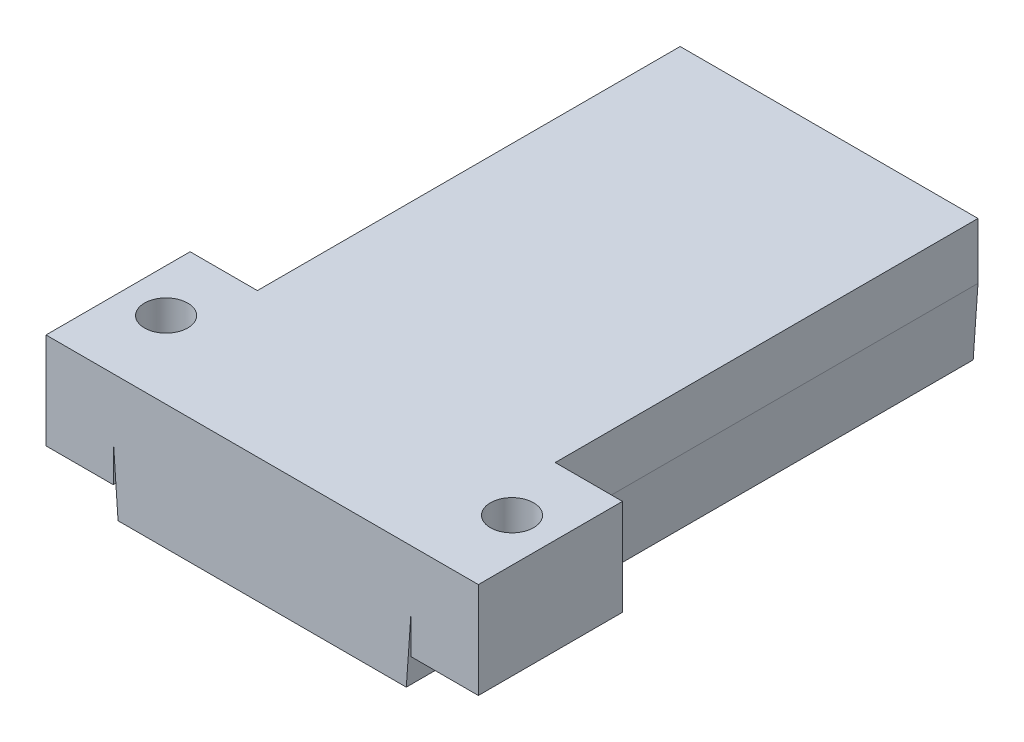
ISO-10303-21;
HEADER;
FILE_DESCRIPTION(('STEP AP214'),'2;1');
FILE_NAME('part.step','',(''),(''),'','','');
FILE_SCHEMA(('AUTOMOTIVE_DESIGN { 1 0 10303 214 1 1 1 1 }'));
ENDSEC;
DATA;
#1=APPLICATION_CONTEXT('core data for automotive mechanical design processes');
#2=APPLICATION_PROTOCOL_DEFINITION('international standard','automotive_design',2000,#1);
#3=PRODUCT_CONTEXT('',#1,'mechanical');
#4=PRODUCT('Part','Part','',(#3));
#5=PRODUCT_RELATED_PRODUCT_CATEGORY('part','',(#4));
#6=PRODUCT_DEFINITION_FORMATION('','',#4);
#7=PRODUCT_DEFINITION_CONTEXT('part definition',#1,'design');
#8=PRODUCT_DEFINITION('design','',#6,#7);
#9=PRODUCT_DEFINITION_SHAPE('','',#8);
#10=(LENGTH_UNIT() NAMED_UNIT(*) SI_UNIT(.MILLI.,.METRE.));
#11=(NAMED_UNIT(*) PLANE_ANGLE_UNIT() SI_UNIT($,.RADIAN.));
#12=(NAMED_UNIT(*) SI_UNIT($,.STERADIAN.) SOLID_ANGLE_UNIT());
#13=UNCERTAINTY_MEASURE_WITH_UNIT(LENGTH_MEASURE(1.E-05),#10,'distance_accuracy_value','');
#14=(GEOMETRIC_REPRESENTATION_CONTEXT(3) GLOBAL_UNCERTAINTY_ASSIGNED_CONTEXT((#13)) GLOBAL_UNIT_ASSIGNED_CONTEXT((#10,
#11,#12)) REPRESENTATION_CONTEXT('',''));
#15=CARTESIAN_POINT('',(0.,0.,0.));
#16=DIRECTION('',(0.,0.,1.));
#17=DIRECTION('',(1.,0.,0.));
#18=AXIS2_PLACEMENT_3D('',#15,#16,#17);
#19=CARTESIAN_POINT('',(-28.5,-5.,-56.));
#20=DIRECTION('',(-1.,0.,0.));
#21=DIRECTION('',(0.,0.,1.));
#22=AXIS2_PLACEMENT_3D('',#19,#20,#21);
#23=PLANE('',#22);
#24=DIRECTION('',(0.,0.,1.));
#25=VECTOR('',#24,1.);
#26=CARTESIAN_POINT('',(-28.5,2.15033312835588,3.));
#27=LINE('',#26,#25);
#28=CARTESIAN_POINT('',(-28.5,2.15033312835588,-56.));
#29=VERTEX_POINT('',#28);
#30=CARTESIAN_POINT('',(-28.5,2.15033312835588,-12.));
#31=VERTEX_POINT('',#30);
#32=EDGE_CURVE('E542',#29,#31,#27,.T.);
#33=ORIENTED_EDGE('',*,*,#32,.T.);
#34=DIRECTION('',(0.,1.,0.));
#35=VECTOR('',#34,1.);
#36=CARTESIAN_POINT('',(-28.5,-2.,-12.));
#37=LINE('',#36,#35);
#38=CARTESIAN_POINT('',(-28.5,8.,-12.));
#39=VERTEX_POINT('',#38);
#40=EDGE_CURVE('E11',#31,#39,#37,.T.);
#41=ORIENTED_EDGE('',*,*,#40,.T.);
#42=DIRECTION('',(0.,0.,1.));
#43=VECTOR('',#42,1.);
#44=CARTESIAN_POINT('',(-28.5,8.,-56.));
#45=LINE('',#44,#43);
#46=CARTESIAN_POINT('',(-28.5,8.,-56.));
#47=VERTEX_POINT('',#46);
#48=EDGE_CURVE('E316',#47,#39,#45,.T.);
#49=ORIENTED_EDGE('',*,*,#48,.F.);
#50=DIRECTION('',(0.,1.,0.));
#51=VECTOR('',#50,1.);
#52=CARTESIAN_POINT('',(-28.5,-5.,-56.));
#53=LINE('',#52,#51);
#54=EDGE_CURVE('E381',#29,#47,#53,.T.);
#55=ORIENTED_EDGE('',*,*,#54,.F.);
#56=EDGE_LOOP('',(#33,#41,#49,#55));
#57=FACE_BOUND('',#56,.T.);
#58=ADVANCED_FACE('F39',(#57),#23,.T.);
#59=CARTESIAN_POINT('',(0.,0.,0.));
#60=DIRECTION('',(0.,1.,0.));
#61=DIRECTION('',(0.,0.,1.));
#62=AXIS2_PLACEMENT_3D('',#59,#60,#61);
#63=PLANE('',#62);
#64=DIRECTION('',(-1.,0.,0.));
#65=VECTOR('',#64,1.);
#66=CARTESIAN_POINT('',(-22.9999999999998,0.,-32.));
#67=LINE('',#66,#65);
#68=CARTESIAN_POINT('',(-2.99999999999983,0.,-32.));
#69=VERTEX_POINT('',#68);
#70=CARTESIAN_POINT('',(-22.9999999999998,0.,-32.));
#71=VERTEX_POINT('',#70);
#72=EDGE_CURVE('E433',#69,#71,#67,.T.);
#73=ORIENTED_EDGE('',*,*,#72,.T.);
#74=DIRECTION('',(0.,0.,1.));
#75=VECTOR('',#74,1.);
#76=CARTESIAN_POINT('',(-22.9999999999998,0.,-32.));
#77=LINE('',#76,#75);
#78=CARTESIAN_POINT('',(-22.9999999999998,0.,-22.));
#79=VERTEX_POINT('',#78);
#80=EDGE_CURVE('E455',#71,#79,#77,.T.);
#81=ORIENTED_EDGE('',*,*,#80,.T.);
#82=DIRECTION('',(1.,0.,0.));
#83=VECTOR('',#82,1.);
#84=CARTESIAN_POINT('',(-22.9999999999998,0.,-22.));
#85=LINE('',#84,#83);
#86=CARTESIAN_POINT('',(-2.99999999999984,0.,-22.));
#87=VERTEX_POINT('',#86);
#88=EDGE_CURVE('E459',#79,#87,#85,.T.);
#89=ORIENTED_EDGE('',*,*,#88,.T.);
#90=DIRECTION('',(0.,0.,-1.));
#91=VECTOR('',#90,1.);
#92=CARTESIAN_POINT('',(-2.99999999999983,0.,-32.));
#93=LINE('',#92,#91);
#94=EDGE_CURVE('E439',#87,#69,#93,.T.);
#95=ORIENTED_EDGE('',*,*,#94,.T.);
#96=EDGE_LOOP('',(#73,#81,#89,#95));
#97=FACE_BOUND('',#96,.T.);
#98=DIRECTION('',(0.,0.,-1.));
#99=VECTOR('',#98,1.);
#100=CARTESIAN_POINT('',(0.,0.,0.));
#101=LINE('',#100,#99);
#102=CARTESIAN_POINT('',(0.,0.,0.));
#103=VERTEX_POINT('',#102);
#104=CARTESIAN_POINT('',(0.,0.,-53.));
#105=VERTEX_POINT('',#104);
#106=EDGE_CURVE('E525',#103,#105,#101,.T.);
#107=ORIENTED_EDGE('',*,*,#106,.F.);
#108=DIRECTION('',(1.,0.,0.));
#109=VECTOR('',#108,1.);
#110=CARTESIAN_POINT('',(0.,0.,0.));
#111=LINE('',#110,#109);
#112=CARTESIAN_POINT('',(-26.,0.,0.));
#113=VERTEX_POINT('',#112);
#114=EDGE_CURVE('E537',#113,#103,#111,.T.);
#115=ORIENTED_EDGE('',*,*,#114,.F.);
#116=DIRECTION('',(0.,0.,1.));
#117=VECTOR('',#116,1.);
#118=CARTESIAN_POINT('',(-26.,0.,0.));
#119=LINE('',#118,#117);
#120=CARTESIAN_POINT('',(-26.,0.,-53.));
#121=VERTEX_POINT('',#120);
#122=EDGE_CURVE('E533',#121,#113,#119,.T.);
#123=ORIENTED_EDGE('',*,*,#122,.F.);
#124=DIRECTION('',(-1.,0.,0.));
#125=VECTOR('',#124,1.);
#126=CARTESIAN_POINT('',(0.,0.,-53.));
#127=LINE('',#126,#125);
#128=EDGE_CURVE('E529',#105,#121,#127,.T.);
#129=ORIENTED_EDGE('',*,*,#128,.F.);
#130=EDGE_LOOP('',(#107,#115,#123,#129));
#131=FACE_BOUND('',#130,.T.);
#132=DIRECTION('',(0.,0.,1.));
#133=VECTOR('',#132,1.);
#134=CARTESIAN_POINT('',(-23.,0.,-48.));
#135=LINE('',#134,#133);
#136=CARTESIAN_POINT('',(-23.,0.,-48.));
#137=VERTEX_POINT('',#136);
#138=CARTESIAN_POINT('',(-23.,0.,-38.));
#139=VERTEX_POINT('',#138);
#140=EDGE_CURVE('E479',#137,#139,#135,.T.);
#141=ORIENTED_EDGE('',*,*,#140,.T.);
#142=DIRECTION('',(1.,0.,0.));
#143=VECTOR('',#142,1.);
#144=CARTESIAN_POINT('',(-23.,0.,-38.));
#145=LINE('',#144,#143);
#146=CARTESIAN_POINT('',(-3.,0.,-38.));
#147=VERTEX_POINT('',#146);
#148=EDGE_CURVE('E501',#139,#147,#145,.T.);
#149=ORIENTED_EDGE('',*,*,#148,.T.);
#150=DIRECTION('',(0.,0.,-1.));
#151=VECTOR('',#150,1.);
#152=CARTESIAN_POINT('',(-3.,0.,-48.));
#153=LINE('',#152,#151);
#154=CARTESIAN_POINT('',(-3.,0.,-48.));
#155=VERTEX_POINT('',#154);
#156=EDGE_CURVE('E505',#147,#155,#153,.T.);
#157=ORIENTED_EDGE('',*,*,#156,.T.);
#158=DIRECTION('',(-1.,0.,0.));
#159=VECTOR('',#158,1.);
#160=CARTESIAN_POINT('',(-23.,0.,-48.));
#161=LINE('',#160,#159);
#162=EDGE_CURVE('E485',#155,#137,#161,.T.);
#163=ORIENTED_EDGE('',*,*,#162,.T.);
#164=EDGE_LOOP('',(#141,#149,#157,#163));
#165=FACE_BOUND('',#164,.T.);
#166=DIRECTION('',(-1.,0.,0.));
#167=VECTOR('',#166,1.);
#168=CARTESIAN_POINT('',(-22.9999999999997,0.,-16.));
#169=LINE('',#168,#167);
#170=CARTESIAN_POINT('',(-2.99999999999966,0.,-16.));
#171=VERTEX_POINT('',#170);
#172=CARTESIAN_POINT('',(-22.9999999999997,0.,-16.));
#173=VERTEX_POINT('',#172);
#174=EDGE_CURVE('E384',#171,#173,#169,.T.);
#175=ORIENTED_EDGE('',*,*,#174,.T.);
#176=DIRECTION('',(0.,0.,1.));
#177=VECTOR('',#176,1.);
#178=CARTESIAN_POINT('',(-22.9999999999997,0.,-16.));
#179=LINE('',#178,#177);
#180=CARTESIAN_POINT('',(-22.9999999999997,0.,-6.));
#181=VERTEX_POINT('',#180);
#182=EDGE_CURVE('E409',#173,#181,#179,.T.);
#183=ORIENTED_EDGE('',*,*,#182,.T.);
#184=DIRECTION('',(1.,0.,0.));
#185=VECTOR('',#184,1.);
#186=CARTESIAN_POINT('',(-22.9999999999997,0.,-6.));
#187=LINE('',#186,#185);
#188=CARTESIAN_POINT('',(-2.99999999999967,0.,-6.));
#189=VERTEX_POINT('',#188);
#190=EDGE_CURVE('E413',#181,#189,#187,.T.);
#191=ORIENTED_EDGE('',*,*,#190,.T.);
#192=DIRECTION('',(0.,0.,-1.));
#193=VECTOR('',#192,1.);
#194=CARTESIAN_POINT('',(-2.99999999999966,0.,-16.));
#195=LINE('',#194,#193);
#196=EDGE_CURVE('E393',#189,#171,#195,.T.);
#197=ORIENTED_EDGE('',*,*,#196,.T.);
#198=EDGE_LOOP('',(#175,#183,#191,#197));
#199=FACE_BOUND('',#198,.T.);
#200=ADVANCED_FACE('F611',(#97,#131,#165,#199),#63,.F.);
#201=CARTESIAN_POINT('',(-23.,5.,-48.));
#202=DIRECTION('',(1.,0.,0.));
#203=DIRECTION('',(0.,0.,-1.));
#204=AXIS2_PLACEMENT_3D('',#201,#202,#203);
#205=PLANE('',#204);
#206=ORIENTED_EDGE('',*,*,#140,.F.);
#207=DIRECTION('',(0.,-1.,0.));
#208=VECTOR('',#207,1.);
#209=CARTESIAN_POINT('',(-23.,5.,-48.));
#210=LINE('',#209,#208);
#211=CARTESIAN_POINT('',(-23.,5.,-48.));
#212=VERTEX_POINT('',#211);
#213=EDGE_CURVE('E497',#212,#137,#210,.T.);
#214=ORIENTED_EDGE('',*,*,#213,.F.);
#215=DIRECTION('',(0.,0.,1.));
#216=VECTOR('',#215,1.);
#217=CARTESIAN_POINT('',(-23.,5.,-48.));
#218=LINE('',#217,#216);
#219=CARTESIAN_POINT('',(-23.,5.,-38.));
#220=VERTEX_POINT('',#219);
#221=EDGE_CURVE('E480',#212,#220,#218,.T.);
#222=ORIENTED_EDGE('',*,*,#221,.T.);
#223=DIRECTION('',(0.,-1.,0.));
#224=VECTOR('',#223,1.);
#225=CARTESIAN_POINT('',(-23.,5.,-38.));
#226=LINE('',#225,#224);
#227=EDGE_CURVE('E521',#220,#139,#226,.T.);
#228=ORIENTED_EDGE('',*,*,#227,.T.);
#229=EDGE_LOOP('',(#206,#214,#222,#228));
#230=FACE_BOUND('',#229,.T.);
#231=ADVANCED_FACE('F617',(#230),#205,.T.);
#232=CARTESIAN_POINT('',(-23.,5.,-38.));
#233=DIRECTION('',(0.,0.,-1.));
#234=DIRECTION('',(-1.,0.,0.));
#235=AXIS2_PLACEMENT_3D('',#232,#233,#234);
#236=PLANE('',#235);
#237=ORIENTED_EDGE('',*,*,#148,.F.);
#238=ORIENTED_EDGE('',*,*,#227,.F.);
#239=DIRECTION('',(1.,0.,0.));
#240=VECTOR('',#239,1.);
#241=CARTESIAN_POINT('',(-23.,5.,-38.));
#242=LINE('',#241,#240);
#243=CARTESIAN_POINT('',(-3.,5.,-38.));
#244=VERTEX_POINT('',#243);
#245=EDGE_CURVE('E484',#220,#244,#242,.T.);
#246=ORIENTED_EDGE('',*,*,#245,.T.);
#247=DIRECTION('',(0.,-1.,0.));
#248=VECTOR('',#247,1.);
#249=CARTESIAN_POINT('',(-3.,5.,-38.));
#250=LINE('',#249,#248);
#251=EDGE_CURVE('E518',#244,#147,#250,.T.);
#252=ORIENTED_EDGE('',*,*,#251,.T.);
#253=EDGE_LOOP('',(#237,#238,#246,#252));
#254=FACE_BOUND('',#253,.T.);
#255=ADVANCED_FACE('F661',(#254),#236,.T.);
#256=CARTESIAN_POINT('',(-3.,5.,-48.));
#257=DIRECTION('',(-1.,0.,0.));
#258=DIRECTION('',(0.,0.,1.));
#259=AXIS2_PLACEMENT_3D('',#256,#257,#258);
#260=PLANE('',#259);
#261=ORIENTED_EDGE('',*,*,#156,.F.);
#262=ORIENTED_EDGE('',*,*,#251,.F.);
#263=DIRECTION('',(0.,0.,-1.));
#264=VECTOR('',#263,1.);
#265=CARTESIAN_POINT('',(-3.,5.,-48.));
#266=LINE('',#265,#264);
#267=CARTESIAN_POINT('',(-3.,5.,-48.));
#268=VERTEX_POINT('',#267);
#269=EDGE_CURVE('E489',#244,#268,#266,.T.);
#270=ORIENTED_EDGE('',*,*,#269,.T.);
#271=DIRECTION('',(0.,-1.,0.));
#272=VECTOR('',#271,1.);
#273=CARTESIAN_POINT('',(-3.,5.,-48.));
#274=LINE('',#273,#272);
#275=EDGE_CURVE('E515',#268,#155,#274,.T.);
#276=ORIENTED_EDGE('',*,*,#275,.T.);
#277=EDGE_LOOP('',(#261,#262,#270,#276));
#278=FACE_BOUND('',#277,.T.);
#279=ADVANCED_FACE('F657',(#278),#260,.T.);
#280=CARTESIAN_POINT('',(-23.,5.,-48.));
#281=DIRECTION('',(0.,0.,1.));
#282=DIRECTION('',(1.,0.,0.));
#283=AXIS2_PLACEMENT_3D('',#280,#281,#282);
#284=PLANE('',#283);
#285=ORIENTED_EDGE('',*,*,#162,.F.);
#286=ORIENTED_EDGE('',*,*,#275,.F.);
#287=DIRECTION('',(-1.,0.,0.));
#288=VECTOR('',#287,1.);
#289=CARTESIAN_POINT('',(-23.,5.,-48.));
#290=LINE('',#289,#288);
#291=EDGE_CURVE('E493',#268,#212,#290,.T.);
#292=ORIENTED_EDGE('',*,*,#291,.T.);
#293=ORIENTED_EDGE('',*,*,#213,.T.);
#294=EDGE_LOOP('',(#285,#286,#292,#293));
#295=FACE_BOUND('',#294,.T.);
#296=ADVANCED_FACE('F653',(#295),#284,.T.);
#297=CARTESIAN_POINT('',(-22.9999999999998,5.,-32.));
#298=DIRECTION('',(0.,0.,1.));
#299=DIRECTION('',(1.,0.,0.));
#300=AXIS2_PLACEMENT_3D('',#297,#298,#299);
#301=PLANE('',#300);
#302=ORIENTED_EDGE('',*,*,#72,.F.);
#303=DIRECTION('',(0.,-1.,0.));
#304=VECTOR('',#303,1.);
#305=CARTESIAN_POINT('',(-2.99999999999983,5.,-32.));
#306=LINE('',#305,#304);
#307=CARTESIAN_POINT('',(-2.99999999999983,5.,-32.));
#308=VERTEX_POINT('',#307);
#309=EDGE_CURVE('E451',#308,#69,#306,.T.);
#310=ORIENTED_EDGE('',*,*,#309,.F.);
#311=DIRECTION('',(-1.,0.,0.));
#312=VECTOR('',#311,1.);
#313=CARTESIAN_POINT('',(-22.9999999999998,5.,-32.));
#314=LINE('',#313,#312);
#315=CARTESIAN_POINT('',(-22.9999999999998,5.,-32.));
#316=VERTEX_POINT('',#315);
#317=EDGE_CURVE('E434',#308,#316,#314,.T.);
#318=ORIENTED_EDGE('',*,*,#317,.T.);
#319=DIRECTION('',(0.,-1.,0.));
#320=VECTOR('',#319,1.);
#321=CARTESIAN_POINT('',(-22.9999999999998,5.,-32.));
#322=LINE('',#321,#320);
#323=EDGE_CURVE('E475',#316,#71,#322,.T.);
#324=ORIENTED_EDGE('',*,*,#323,.T.);
#325=EDGE_LOOP('',(#302,#310,#318,#324));
#326=FACE_BOUND('',#325,.T.);
#327=ADVANCED_FACE('F649',(#326),#301,.T.);
#328=CARTESIAN_POINT('',(-22.9999999999998,5.,-32.));
#329=DIRECTION('',(1.,0.,0.));
#330=DIRECTION('',(0.,0.,-1.));
#331=AXIS2_PLACEMENT_3D('',#328,#329,#330);
#332=PLANE('',#331);
#333=ORIENTED_EDGE('',*,*,#80,.F.);
#334=ORIENTED_EDGE('',*,*,#323,.F.);
#335=DIRECTION('',(0.,0.,1.));
#336=VECTOR('',#335,1.);
#337=CARTESIAN_POINT('',(-22.9999999999998,5.,-32.));
#338=LINE('',#337,#336);
#339=CARTESIAN_POINT('',(-22.9999999999998,5.,-22.));
#340=VERTEX_POINT('',#339);
#341=EDGE_CURVE('E438',#316,#340,#338,.T.);
#342=ORIENTED_EDGE('',*,*,#341,.T.);
#343=DIRECTION('',(0.,-1.,0.));
#344=VECTOR('',#343,1.);
#345=CARTESIAN_POINT('',(-22.9999999999998,5.,-22.));
#346=LINE('',#345,#344);
#347=EDGE_CURVE('E472',#340,#79,#346,.T.);
#348=ORIENTED_EDGE('',*,*,#347,.T.);
#349=EDGE_LOOP('',(#333,#334,#342,#348));
#350=FACE_BOUND('',#349,.T.);
#351=ADVANCED_FACE('F645',(#350),#332,.T.);
#352=CARTESIAN_POINT('',(-22.9999999999998,5.,-22.));
#353=DIRECTION('',(0.,0.,-1.));
#354=DIRECTION('',(-1.,0.,0.));
#355=AXIS2_PLACEMENT_3D('',#352,#353,#354);
#356=PLANE('',#355);
#357=ORIENTED_EDGE('',*,*,#88,.F.);
#358=ORIENTED_EDGE('',*,*,#347,.F.);
#359=DIRECTION('',(1.,0.,0.));
#360=VECTOR('',#359,1.);
#361=CARTESIAN_POINT('',(-22.9999999999998,5.,-22.));
#362=LINE('',#361,#360);
#363=CARTESIAN_POINT('',(-2.99999999999984,5.,-22.));
#364=VERTEX_POINT('',#363);
#365=EDGE_CURVE('E443',#340,#364,#362,.T.);
#366=ORIENTED_EDGE('',*,*,#365,.T.);
#367=DIRECTION('',(0.,-1.,0.));
#368=VECTOR('',#367,1.);
#369=CARTESIAN_POINT('',(-2.99999999999984,5.,-22.));
#370=LINE('',#369,#368);
#371=EDGE_CURVE('E469',#364,#87,#370,.T.);
#372=ORIENTED_EDGE('',*,*,#371,.T.);
#373=EDGE_LOOP('',(#357,#358,#366,#372));
#374=FACE_BOUND('',#373,.T.);
#375=ADVANCED_FACE('F641',(#374),#356,.T.);
#376=CARTESIAN_POINT('',(-2.99999999999983,5.,-32.));
#377=DIRECTION('',(-1.,0.,0.));
#378=DIRECTION('',(0.,0.,1.));
#379=AXIS2_PLACEMENT_3D('',#376,#377,#378);
#380=PLANE('',#379);
#381=ORIENTED_EDGE('',*,*,#94,.F.);
#382=ORIENTED_EDGE('',*,*,#371,.F.);
#383=DIRECTION('',(0.,0.,-1.));
#384=VECTOR('',#383,1.);
#385=CARTESIAN_POINT('',(-2.99999999999983,5.,-32.));
#386=LINE('',#385,#384);
#387=EDGE_CURVE('E447',#364,#308,#386,.T.);
#388=ORIENTED_EDGE('',*,*,#387,.T.);
#389=ORIENTED_EDGE('',*,*,#309,.T.);
#390=EDGE_LOOP('',(#381,#382,#388,#389));
#391=FACE_BOUND('',#390,.T.);
#392=ADVANCED_FACE('F637',(#391),#380,.T.);
#393=CARTESIAN_POINT('',(-22.9999999999997,5.,-16.));
#394=DIRECTION('',(0.,0.,1.));
#395=DIRECTION('',(1.,0.,0.));
#396=AXIS2_PLACEMENT_3D('',#393,#394,#395);
#397=PLANE('',#396);
#398=ORIENTED_EDGE('',*,*,#174,.F.);
#399=DIRECTION('',(0.,-1.,0.));
#400=VECTOR('',#399,1.);
#401=CARTESIAN_POINT('',(-2.99999999999966,5.,-16.));
#402=LINE('',#401,#400);
#403=CARTESIAN_POINT('',(-2.99999999999966,5.,-16.));
#404=VERTEX_POINT('',#403);
#405=EDGE_CURVE('E405',#404,#171,#402,.T.);
#406=ORIENTED_EDGE('',*,*,#405,.F.);
#407=DIRECTION('',(-1.,0.,0.));
#408=VECTOR('',#407,1.);
#409=CARTESIAN_POINT('',(-22.9999999999997,5.,-16.));
#410=LINE('',#409,#408);
#411=CARTESIAN_POINT('',(-22.9999999999997,5.,-16.));
#412=VERTEX_POINT('',#411);
#413=EDGE_CURVE('E388',#404,#412,#410,.T.);
#414=ORIENTED_EDGE('',*,*,#413,.T.);
#415=DIRECTION('',(0.,-1.,0.));
#416=VECTOR('',#415,1.);
#417=CARTESIAN_POINT('',(-22.9999999999997,5.,-16.));
#418=LINE('',#417,#416);
#419=EDGE_CURVE('E429',#412,#173,#418,.T.);
#420=ORIENTED_EDGE('',*,*,#419,.T.);
#421=EDGE_LOOP('',(#398,#406,#414,#420));
#422=FACE_BOUND('',#421,.T.);
#423=ADVANCED_FACE('F633',(#422),#397,.T.);
#424=CARTESIAN_POINT('',(-22.9999999999997,5.,-16.));
#425=DIRECTION('',(1.,0.,0.));
#426=DIRECTION('',(0.,0.,-1.));
#427=AXIS2_PLACEMENT_3D('',#424,#425,#426);
#428=PLANE('',#427);
#429=ORIENTED_EDGE('',*,*,#182,.F.);
#430=ORIENTED_EDGE('',*,*,#419,.F.);
#431=DIRECTION('',(0.,0.,1.));
#432=VECTOR('',#431,1.);
#433=CARTESIAN_POINT('',(-22.9999999999997,5.,-16.));
#434=LINE('',#433,#432);
#435=CARTESIAN_POINT('',(-22.9999999999997,5.,-6.));
#436=VERTEX_POINT('',#435);
#437=EDGE_CURVE('E392',#412,#436,#434,.T.);
#438=ORIENTED_EDGE('',*,*,#437,.T.);
#439=DIRECTION('',(0.,-1.,0.));
#440=VECTOR('',#439,1.);
#441=CARTESIAN_POINT('',(-22.9999999999997,5.,-6.));
#442=LINE('',#441,#440);
#443=EDGE_CURVE('E426',#436,#181,#442,.T.);
#444=ORIENTED_EDGE('',*,*,#443,.T.);
#445=EDGE_LOOP('',(#429,#430,#438,#444));
#446=FACE_BOUND('',#445,.T.);
#447=ADVANCED_FACE('F629',(#446),#428,.T.);
#448=CARTESIAN_POINT('',(-22.9999999999997,5.,-6.));
#449=DIRECTION('',(0.,0.,-1.));
#450=DIRECTION('',(-1.,0.,0.));
#451=AXIS2_PLACEMENT_3D('',#448,#449,#450);
#452=PLANE('',#451);
#453=ORIENTED_EDGE('',*,*,#190,.F.);
#454=ORIENTED_EDGE('',*,*,#443,.F.);
#455=DIRECTION('',(1.,0.,0.));
#456=VECTOR('',#455,1.);
#457=CARTESIAN_POINT('',(-22.9999999999997,5.,-6.));
#458=LINE('',#457,#456);
#459=CARTESIAN_POINT('',(-2.99999999999967,5.,-6.));
#460=VERTEX_POINT('',#459);
#461=EDGE_CURVE('E397',#436,#460,#458,.T.);
#462=ORIENTED_EDGE('',*,*,#461,.T.);
#463=DIRECTION('',(0.,-1.,0.));
#464=VECTOR('',#463,1.);
#465=CARTESIAN_POINT('',(-2.99999999999967,5.,-6.));
#466=LINE('',#465,#464);
#467=EDGE_CURVE('E423',#460,#189,#466,.T.);
#468=ORIENTED_EDGE('',*,*,#467,.T.);
#469=EDGE_LOOP('',(#453,#454,#462,#468));
#470=FACE_BOUND('',#469,.T.);
#471=ADVANCED_FACE('F625',(#470),#452,.T.);
#472=CARTESIAN_POINT('',(-2.99999999999966,5.,-16.));
#473=DIRECTION('',(-1.,0.,0.));
#474=DIRECTION('',(0.,0.,1.));
#475=AXIS2_PLACEMENT_3D('',#472,#473,#474);
#476=PLANE('',#475);
#477=ORIENTED_EDGE('',*,*,#196,.F.);
#478=ORIENTED_EDGE('',*,*,#467,.F.);
#479=DIRECTION('',(0.,0.,-1.));
#480=VECTOR('',#479,1.);
#481=CARTESIAN_POINT('',(-2.99999999999966,5.,-16.));
#482=LINE('',#481,#480);
#483=EDGE_CURVE('E401',#460,#404,#482,.T.);
#484=ORIENTED_EDGE('',*,*,#483,.T.);
#485=ORIENTED_EDGE('',*,*,#405,.T.);
#486=EDGE_LOOP('',(#477,#478,#484,#485));
#487=FACE_BOUND('',#486,.T.);
#488=ADVANCED_FACE('F621',(#487),#476,.T.);
#489=CARTESIAN_POINT('',(-26.,-5.,-53.));
#490=DIRECTION('',(0.,0.,-1.));
#491=DIRECTION('',(-1.,0.,0.));
#492=AXIS2_PLACEMENT_3D('',#489,#490,#491);
#493=PLANE('',#492);
#494=DIRECTION('',(0.,1.,0.));
#495=VECTOR('',#494,1.);
#496=CARTESIAN_POINT('',(0.,-5.,-53.));
#497=LINE('',#496,#495);
#498=CARTESIAN_POINT('',(0.,-5.,-53.));
#499=VERTEX_POINT('',#498);
#500=EDGE_CURVE('E362',#499,#105,#497,.T.);
#501=ORIENTED_EDGE('',*,*,#500,.T.);
#502=ORIENTED_EDGE('',*,*,#128,.T.);
#503=DIRECTION('',(0.,1.,0.));
#504=VECTOR('',#503,1.);
#505=CARTESIAN_POINT('',(-26.,-5.,-53.));
#506=LINE('',#505,#504);
#507=CARTESIAN_POINT('',(-26.,-5.,-53.));
#508=VERTEX_POINT('',#507);
#509=EDGE_CURVE('E357',#508,#121,#506,.T.);
#510=ORIENTED_EDGE('',*,*,#509,.F.);
#511=DIRECTION('',(-1.,0.,0.));
#512=VECTOR('',#511,1.);
#513=CARTESIAN_POINT('',(-26.,-5.,-53.));
#514=LINE('',#513,#512);
#515=EDGE_CURVE('E352',#499,#508,#514,.T.);
#516=ORIENTED_EDGE('',*,*,#515,.F.);
#517=EDGE_LOOP('',(#501,#502,#510,#516));
#518=FACE_BOUND('',#517,.T.);
#519=ADVANCED_FACE('F624',(#518),#493,.F.);
#520=CARTESIAN_POINT('',(-26.,-5.,0.));
#521=DIRECTION('',(0.,0.,1.));
#522=DIRECTION('',(1.,0.,0.));
#523=AXIS2_PLACEMENT_3D('',#520,#521,#522);
#524=PLANE('',#523);
#525=DIRECTION('',(0.,1.,0.));
#526=VECTOR('',#525,1.);
#527=CARTESIAN_POINT('',(-26.,-5.,0.));
#528=LINE('',#527,#526);
#529=CARTESIAN_POINT('',(-26.,-5.,0.));
#530=VERTEX_POINT('',#529);
#531=EDGE_CURVE('E356',#530,#113,#528,.T.);
#532=ORIENTED_EDGE('',*,*,#531,.T.);
#533=ORIENTED_EDGE('',*,*,#114,.T.);
#534=DIRECTION('',(0.,1.,0.));
#535=VECTOR('',#534,1.);
#536=CARTESIAN_POINT('',(0.,-5.,0.));
#537=LINE('',#536,#535);
#538=CARTESIAN_POINT('',(0.,-5.,0.));
#539=VERTEX_POINT('',#538);
#540=EDGE_CURVE('E366',#539,#103,#537,.T.);
#541=ORIENTED_EDGE('',*,*,#540,.F.);
#542=DIRECTION('',(1.,0.,0.));
#543=VECTOR('',#542,1.);
#544=CARTESIAN_POINT('',(-26.,-5.,0.));
#545=LINE('',#544,#543);
#546=EDGE_CURVE('E344',#530,#539,#545,.T.);
#547=ORIENTED_EDGE('',*,*,#546,.F.);
#548=EDGE_LOOP('',(#532,#533,#541,#547));
#549=FACE_BOUND('',#548,.T.);
#550=ADVANCED_FACE('F699',(#549),#524,.F.);
#551=CARTESIAN_POINT('',(-26.,-5.,-53.));
#552=DIRECTION('',(-1.,0.,0.));
#553=DIRECTION('',(0.,0.,1.));
#554=AXIS2_PLACEMENT_3D('',#551,#552,#553);
#555=PLANE('',#554);
#556=ORIENTED_EDGE('',*,*,#509,.T.);
#557=ORIENTED_EDGE('',*,*,#122,.T.);
#558=ORIENTED_EDGE('',*,*,#531,.F.);
#559=DIRECTION('',(0.,0.,1.));
#560=VECTOR('',#559,1.);
#561=CARTESIAN_POINT('',(-26.,-5.,-53.));
#562=LINE('',#561,#560);
#563=EDGE_CURVE('E340',#508,#530,#562,.T.);
#564=ORIENTED_EDGE('',*,*,#563,.F.);
#565=EDGE_LOOP('',(#556,#557,#558,#564));
#566=FACE_BOUND('',#565,.T.);
#567=ADVANCED_FACE('F696',(#566),#555,.F.);
#568=CARTESIAN_POINT('',(0.,-5.,-53.));
#569=DIRECTION('',(1.,0.,0.));
#570=DIRECTION('',(0.,0.,-1.));
#571=AXIS2_PLACEMENT_3D('',#568,#569,#570);
#572=PLANE('',#571);
#573=ORIENTED_EDGE('',*,*,#540,.T.);
#574=ORIENTED_EDGE('',*,*,#106,.T.);
#575=ORIENTED_EDGE('',*,*,#500,.F.);
#576=DIRECTION('',(0.,0.,-1.));
#577=VECTOR('',#576,1.);
#578=CARTESIAN_POINT('',(0.,-5.,-53.));
#579=LINE('',#578,#577);
#580=EDGE_CURVE('E348',#539,#499,#579,.T.);
#581=ORIENTED_EDGE('',*,*,#580,.F.);
#582=EDGE_LOOP('',(#573,#574,#575,#581));
#583=FACE_BOUND('',#582,.T.);
#584=ADVANCED_FACE('F608',(#583),#572,.F.);
#585=CARTESIAN_POINT('',(-28.5,-5.,-56.));
#586=DIRECTION('',(0.,0.,-1.));
#587=DIRECTION('',(-1.,0.,0.));
#588=AXIS2_PLACEMENT_3D('',#585,#586,#587);
#589=PLANE('',#588);
#590=DIRECTION('',(-1.,0.,0.));
#591=VECTOR('',#590,1.);
#592=CARTESIAN_POINT('',(-28.5,-5.,-56.));
#593=LINE('',#592,#591);
#594=CARTESIAN_POINT('',(2.,-5.,-56.));
#595=VERTEX_POINT('',#594);
#596=CARTESIAN_POINT('',(-28.,-5.,-56.));
#597=VERTEX_POINT('',#596);
#598=EDGE_CURVE('E376',#595,#597,#593,.T.);
#599=ORIENTED_EDGE('',*,*,#598,.T.);
#600=DIRECTION('',(-0.0697564737441263,0.997564050259824,0.));
#601=VECTOR('',#600,1.);
#602=CARTESIAN_POINT('',(-28.0024329828146,-4.96520672475998,-56.));
#603=LINE('',#602,#601);
#604=EDGE_CURVE('E560',#597,#29,#603,.T.);
#605=ORIENTED_EDGE('',*,*,#604,.T.);
#606=ORIENTED_EDGE('',*,*,#54,.T.);
#607=DIRECTION('',(-1.,0.,0.));
#608=VECTOR('',#607,1.);
#609=CARTESIAN_POINT('',(-28.5,8.,-56.));
#610=LINE('',#609,#608);
#611=CARTESIAN_POINT('',(2.5,8.,-56.));
#612=VERTEX_POINT('',#611);
#613=EDGE_CURVE('E336',#612,#47,#610,.T.);
#614=ORIENTED_EDGE('',*,*,#613,.F.);
#615=DIRECTION('',(0.,1.,0.));
#616=VECTOR('',#615,1.);
#617=CARTESIAN_POINT('',(2.5,-5.,-56.));
#618=LINE('',#617,#616);
#619=CARTESIAN_POINT('',(2.5,2.15033312835588,-56.));
#620=VERTEX_POINT('',#619);
#621=EDGE_CURVE('E380',#620,#612,#618,.T.);
#622=ORIENTED_EDGE('',*,*,#621,.F.);
#623=DIRECTION('',(-0.0697564737441261,-0.997564050259824,0.));
#624=VECTOR('',#623,1.);
#625=CARTESIAN_POINT('',(1.85158804830894,-7.12238978964102,-56.));
#626=LINE('',#625,#624);
#627=EDGE_CURVE('E558',#620,#595,#626,.T.);
#628=ORIENTED_EDGE('',*,*,#627,.T.);
#629=EDGE_LOOP('',(#599,#605,#606,#614,#622,#628));
#630=FACE_BOUND('',#629,.T.);
#631=ADVANCED_FACE('F598',(#630),#589,.T.);
#632=CARTESIAN_POINT('',(2.5,-5.,-56.));
#633=DIRECTION('',(1.,0.,0.));
#634=DIRECTION('',(0.,0.,-1.));
#635=AXIS2_PLACEMENT_3D('',#632,#633,#634);
#636=PLANE('',#635);
#637=DIRECTION('',(0.,1.,0.));
#638=VECTOR('',#637,1.);
#639=CARTESIAN_POINT('',(2.50000000000001,-2.,-12.));
#640=LINE('',#639,#638);
#641=CARTESIAN_POINT('',(2.50000000000001,2.15033312835588,-12.));
#642=VERTEX_POINT('',#641);
#643=CARTESIAN_POINT('',(2.50000000000001,8.,-12.));
#644=VERTEX_POINT('',#643);
#645=EDGE_CURVE('E49',#642,#644,#640,.T.);
#646=ORIENTED_EDGE('',*,*,#645,.F.);
#647=DIRECTION('',(0.,0.,-1.));
#648=VECTOR('',#647,1.);
#649=CARTESIAN_POINT('',(2.5,2.15033312835588,-56.));
#650=LINE('',#649,#648);
#651=EDGE_CURVE('E562',#642,#620,#650,.T.);
#652=ORIENTED_EDGE('',*,*,#651,.T.);
#653=ORIENTED_EDGE('',*,*,#621,.T.);
#654=DIRECTION('',(0.,0.,-1.));
#655=VECTOR('',#654,1.);
#656=CARTESIAN_POINT('',(2.5,8.,-56.));
#657=LINE('',#656,#655);
#658=EDGE_CURVE('E333',#644,#612,#657,.T.);
#659=ORIENTED_EDGE('',*,*,#658,.F.);
#660=EDGE_LOOP('',(#646,#652,#653,#659));
#661=FACE_BOUND('',#660,.T.);
#662=ADVANCED_FACE('F599',(#661),#636,.T.);
#663=CARTESIAN_POINT('',(-28.5,-5.,3.));
#664=DIRECTION('',(0.,0.,1.));
#665=DIRECTION('',(1.,0.,0.));
#666=AXIS2_PLACEMENT_3D('',#663,#664,#665);
#667=PLANE('',#666);
#668=DIRECTION('',(1.,0.,0.));
#669=VECTOR('',#668,1.);
#670=CARTESIAN_POINT('',(-28.5,8.,3.));
#671=LINE('',#670,#669);
#672=CARTESIAN_POINT('',(-35.5,8.,3.));
#673=VERTEX_POINT('',#672);
#674=CARTESIAN_POINT('',(9.50000000000001,8.,3.));
#675=VERTEX_POINT('',#674);
#676=EDGE_CURVE('E330',#673,#675,#671,.T.);
#677=ORIENTED_EDGE('',*,*,#676,.F.);
#678=DIRECTION('',(0.,1.,0.));
#679=VECTOR('',#678,1.);
#680=CARTESIAN_POINT('',(-35.5,-2.,3.));
#681=LINE('',#680,#679);
#682=CARTESIAN_POINT('',(-35.5,-2.,3.));
#683=VERTEX_POINT('',#682);
#684=EDGE_CURVE('E274',#683,#673,#681,.T.);
#685=ORIENTED_EDGE('',*,*,#684,.F.);
#686=DIRECTION('',(1.,0.,0.));
#687=VECTOR('',#686,1.);
#688=CARTESIAN_POINT('',(-28.5,-2.,3.));
#689=LINE('',#688,#687);
#690=CARTESIAN_POINT('',(-28.5,-2.,3.));
#691=VERTEX_POINT('',#690);
#692=EDGE_CURVE('E239',#683,#691,#689,.T.);
#693=ORIENTED_EDGE('',*,*,#692,.T.);
#694=DIRECTION('',(0.,1.,0.));
#695=VECTOR('',#694,1.);
#696=CARTESIAN_POINT('',(-28.5,-2.,3.));
#697=LINE('',#696,#695);
#698=CARTESIAN_POINT('',(-28.5,2.15033312835588,3.));
#699=VERTEX_POINT('',#698);
#700=EDGE_CURVE('E253',#691,#699,#697,.T.);
#701=ORIENTED_EDGE('',*,*,#700,.T.);
#702=DIRECTION('',(0.0697564737441263,-0.997564050259824,0.));
#703=VECTOR('',#702,1.);
#704=CARTESIAN_POINT('',(-28.0024329828146,-4.96520672475998,3.));
#705=LINE('',#704,#703);
#706=CARTESIAN_POINT('',(-28.,-5.,3.));
#707=VERTEX_POINT('',#706);
#708=EDGE_CURVE('E549',#699,#707,#705,.T.);
#709=ORIENTED_EDGE('',*,*,#708,.T.);
#710=DIRECTION('',(1.,0.,0.));
#711=VECTOR('',#710,1.);
#712=CARTESIAN_POINT('',(-28.5,-5.,3.));
#713=LINE('',#712,#711);
#714=CARTESIAN_POINT('',(2.00000000000001,-5.,3.));
#715=VERTEX_POINT('',#714);
#716=EDGE_CURVE('E361',#707,#715,#713,.T.);
#717=ORIENTED_EDGE('',*,*,#716,.T.);
#718=DIRECTION('',(0.0697564737441261,0.997564050259824,0.));
#719=VECTOR('',#718,1.);
#720=CARTESIAN_POINT('',(1.85158804830895,-7.12238978964102,3.));
#721=LINE('',#720,#719);
#722=CARTESIAN_POINT('',(2.50000000000001,2.15033312835588,3.));
#723=VERTEX_POINT('',#722);
#724=EDGE_CURVE('E546',#715,#723,#721,.T.);
#725=ORIENTED_EDGE('',*,*,#724,.T.);
#726=DIRECTION('',(0.,1.,0.));
#727=VECTOR('',#726,1.);
#728=CARTESIAN_POINT('',(2.50000000000001,-2.,3.));
#729=LINE('',#728,#727);
#730=CARTESIAN_POINT('',(2.50000000000001,-2.,3.));
#731=VERTEX_POINT('',#730);
#732=EDGE_CURVE('E305',#731,#723,#729,.T.);
#733=ORIENTED_EDGE('',*,*,#732,.F.);
#734=DIRECTION('',(1.,0.,0.));
#735=VECTOR('',#734,1.);
#736=CARTESIAN_POINT('',(2.50000000000001,-2.,3.));
#737=LINE('',#736,#735);
#738=CARTESIAN_POINT('',(9.50000000000001,-2.,3.));
#739=VERTEX_POINT('',#738);
#740=EDGE_CURVE('E292',#731,#739,#737,.T.);
#741=ORIENTED_EDGE('',*,*,#740,.T.);
#742=DIRECTION('',(0.,1.,0.));
#743=VECTOR('',#742,1.);
#744=CARTESIAN_POINT('',(9.50000000000001,-2.,3.));
#745=LINE('',#744,#743);
#746=EDGE_CURVE('E320',#739,#675,#745,.T.);
#747=ORIENTED_EDGE('',*,*,#746,.T.);
#748=EDGE_LOOP('',(#677,#685,#693,#701,#709,#717,#725,#733,#741,#747));
#749=FACE_BOUND('',#748,.T.);
#750=ADVANCED_FACE('F590',(#749),#667,.T.);
#751=CARTESIAN_POINT('',(0.,-5.,0.));
#752=DIRECTION('',(0.,1.,0.));
#753=DIRECTION('',(0.,0.,1.));
#754=AXIS2_PLACEMENT_3D('',#751,#752,#753);
#755=PLANE('',#754);
#756=ORIENTED_EDGE('',*,*,#515,.T.);
#757=ORIENTED_EDGE('',*,*,#563,.T.);
#758=ORIENTED_EDGE('',*,*,#546,.T.);
#759=ORIENTED_EDGE('',*,*,#580,.T.);
#760=EDGE_LOOP('',(#756,#757,#758,#759));
#761=FACE_BOUND('',#760,.T.);
#762=ORIENTED_EDGE('',*,*,#716,.F.);
#763=DIRECTION('',(0.,0.,-1.));
#764=VECTOR('',#763,1.);
#765=CARTESIAN_POINT('',(-28.,-5.,-56.));
#766=LINE('',#765,#764);
#767=EDGE_CURVE('E555',#707,#597,#766,.T.);
#768=ORIENTED_EDGE('',*,*,#767,.T.);
#769=ORIENTED_EDGE('',*,*,#598,.F.);
#770=DIRECTION('',(0.,0.,1.));
#771=VECTOR('',#770,1.);
#772=CARTESIAN_POINT('',(2.00000000000001,-5.,3.));
#773=LINE('',#772,#771);
#774=EDGE_CURVE('E552',#595,#715,#773,.T.);
#775=ORIENTED_EDGE('',*,*,#774,.T.);
#776=EDGE_LOOP('',(#762,#768,#769,#775));
#777=FACE_BOUND('',#776,.T.);
#778=ADVANCED_FACE('F606',(#761,#777),#755,.F.);
#779=CARTESIAN_POINT('',(0.,5.,0.));
#780=DIRECTION('',(0.,1.,0.));
#781=DIRECTION('',(0.,0.,1.));
#782=AXIS2_PLACEMENT_3D('',#779,#780,#781);
#783=PLANE('',#782);
#784=ORIENTED_EDGE('',*,*,#437,.F.);
#785=ORIENTED_EDGE('',*,*,#413,.F.);
#786=ORIENTED_EDGE('',*,*,#483,.F.);
#787=ORIENTED_EDGE('',*,*,#461,.F.);
#788=EDGE_LOOP('',(#784,#785,#786,#787));
#789=FACE_BOUND('',#788,.T.);
#790=ADVANCED_FACE('F686',(#789),#783,.F.);
#791=ORIENTED_EDGE('',*,*,#341,.F.);
#792=ORIENTED_EDGE('',*,*,#317,.F.);
#793=ORIENTED_EDGE('',*,*,#387,.F.);
#794=ORIENTED_EDGE('',*,*,#365,.F.);
#795=EDGE_LOOP('',(#791,#792,#793,#794));
#796=FACE_BOUND('',#795,.T.);
#797=ADVANCED_FACE('F692',(#796),#783,.F.);
#798=ORIENTED_EDGE('',*,*,#245,.F.);
#799=ORIENTED_EDGE('',*,*,#221,.F.);
#800=ORIENTED_EDGE('',*,*,#291,.F.);
#801=ORIENTED_EDGE('',*,*,#269,.F.);
#802=EDGE_LOOP('',(#798,#799,#800,#801));
#803=FACE_BOUND('',#802,.T.);
#804=ADVANCED_FACE('F675',(#803),#783,.F.);
#805=CARTESIAN_POINT('',(0.,8.,0.));
#806=DIRECTION('',(0.,1.,0.));
#807=DIRECTION('',(0.,0.,1.));
#808=AXIS2_PLACEMENT_3D('',#805,#806,#807);
#809=PLANE('',#808);
#810=ORIENTED_EDGE('',*,*,#48,.T.);
#811=DIRECTION('',(-1.,0.,0.));
#812=VECTOR('',#811,1.);
#813=CARTESIAN_POINT('',(-28.5,8.,-12.));
#814=LINE('',#813,#812);
#815=CARTESIAN_POINT('',(-35.5,8.,-12.));
#816=VERTEX_POINT('',#815);
#817=EDGE_CURVE('E58',#39,#816,#814,.T.);
#818=ORIENTED_EDGE('',*,*,#817,.T.);
#819=DIRECTION('',(0.,0.,1.));
#820=VECTOR('',#819,1.);
#821=CARTESIAN_POINT('',(-35.5,8.,3.));
#822=LINE('',#821,#820);
#823=EDGE_CURVE('E255',#816,#673,#822,.T.);
#824=ORIENTED_EDGE('',*,*,#823,.T.);
#825=ORIENTED_EDGE('',*,*,#676,.T.);
#826=DIRECTION('',(0.,0.,-1.));
#827=VECTOR('',#826,1.);
#828=CARTESIAN_POINT('',(9.50000000000001,8.,3.));
#829=LINE('',#828,#827);
#830=CARTESIAN_POINT('',(9.50000000000001,8.,-12.));
#831=VERTEX_POINT('',#830);
#832=EDGE_CURVE('E284',#675,#831,#829,.T.);
#833=ORIENTED_EDGE('',*,*,#832,.T.);
#834=DIRECTION('',(-1.,0.,0.));
#835=VECTOR('',#834,1.);
#836=CARTESIAN_POINT('',(2.50000000000001,8.,-12.));
#837=LINE('',#836,#835);
#838=EDGE_CURVE('E293',#831,#644,#837,.T.);
#839=ORIENTED_EDGE('',*,*,#838,.T.);
#840=ORIENTED_EDGE('',*,*,#658,.T.);
#841=ORIENTED_EDGE('',*,*,#613,.T.);
#842=EDGE_LOOP('',(#810,#818,#824,#825,#833,#839,#840,#841));
#843=FACE_BOUND('',#842,.T.);
#844=CARTESIAN_POINT('',(5.00000000000001,8.,-5.));
#845=DIRECTION('',(0.,1.,0.));
#846=DIRECTION('',(0.,0.,1.));
#847=AXIS2_PLACEMENT_3D('',#844,#845,#846);
#848=CIRCLE('',#847,2.25);
#849=CARTESIAN_POINT('',(5.00000000000001,8.,-2.75));
#850=VERTEX_POINT('',#849);
#851=EDGE_CURVE('E273',#850,#850,#848,.T.);
#852=ORIENTED_EDGE('',*,*,#851,.F.);
#853=EDGE_LOOP('',(#852));
#854=FACE_BOUND('',#853,.T.);
#855=CARTESIAN_POINT('',(-31.,8.,-5.));
#856=DIRECTION('',(0.,1.,0.));
#857=DIRECTION('',(0.,0.,-1.));
#858=AXIS2_PLACEMENT_3D('',#855,#856,#857);
#859=CIRCLE('',#858,2.25);
#860=CARTESIAN_POINT('',(-31.,8.,-7.25));
#861=VERTEX_POINT('',#860);
#862=EDGE_CURVE('E261',#861,#861,#859,.T.);
#863=ORIENTED_EDGE('',*,*,#862,.F.);
#864=EDGE_LOOP('',(#863));
#865=FACE_BOUND('',#864,.T.);
#866=ADVANCED_FACE('F577',(#843,#854,#865),#809,.T.);
#867=CARTESIAN_POINT('',(-28.5,2.15033312835588,-56.));
#868=DIRECTION('',(-0.997564050259824,-0.0697564737441263,0.));
#869=DIRECTION('',(0.,0.,-1.));
#870=AXIS2_PLACEMENT_3D('',#867,#868,#869);
#871=PLANE('',#870);
#872=ORIENTED_EDGE('',*,*,#604,.F.);
#873=ORIENTED_EDGE('',*,*,#767,.F.);
#874=ORIENTED_EDGE('',*,*,#708,.F.);
#875=EDGE_CURVE('E541',#31,#699,#27,.T.);
#876=ORIENTED_EDGE('',*,*,#875,.F.);
#877=ORIENTED_EDGE('',*,*,#32,.F.);
#878=EDGE_LOOP('',(#872,#873,#874,#876,#877));
#879=FACE_BOUND('',#878,.T.);
#880=ADVANCED_FACE('F668',(#879),#871,.T.);
#881=CARTESIAN_POINT('',(2.5,2.15033312835588,-56.));
#882=DIRECTION('',(0.997564050259824,-0.0697564737441261,0.));
#883=DIRECTION('',(0.,0.,1.));
#884=AXIS2_PLACEMENT_3D('',#881,#882,#883);
#885=PLANE('',#884);
#886=ORIENTED_EDGE('',*,*,#724,.F.);
#887=ORIENTED_EDGE('',*,*,#774,.F.);
#888=ORIENTED_EDGE('',*,*,#627,.F.);
#889=ORIENTED_EDGE('',*,*,#651,.F.);
#890=EDGE_CURVE('E43',#723,#642,#650,.T.);
#891=ORIENTED_EDGE('',*,*,#890,.F.);
#892=EDGE_LOOP('',(#886,#887,#888,#889,#891));
#893=FACE_BOUND('',#892,.T.);
#894=ADVANCED_FACE('F41',(#893),#885,.T.);
#895=CARTESIAN_POINT('',(2.50000000000001,-2.,3.));
#896=DIRECTION('',(-1.,0.,0.));
#897=DIRECTION('',(0.,0.,1.));
#898=AXIS2_PLACEMENT_3D('',#895,#896,#897);
#899=PLANE('',#898);
#900=ORIENTED_EDGE('',*,*,#732,.T.);
#901=ORIENTED_EDGE('',*,*,#890,.T.);
#902=CARTESIAN_POINT('',(2.50000000000001,-2.,-12.));
#903=VERTEX_POINT('',#902);
#904=EDGE_CURVE('E312',#903,#642,#640,.T.);
#905=ORIENTED_EDGE('',*,*,#904,.F.);
#906=DIRECTION('',(0.,0.,1.));
#907=VECTOR('',#906,1.);
#908=CARTESIAN_POINT('',(2.50000000000001,-2.,3.));
#909=LINE('',#908,#907);
#910=EDGE_CURVE('E288',#903,#731,#909,.T.);
#911=ORIENTED_EDGE('',*,*,#910,.T.);
#912=EDGE_LOOP('',(#900,#901,#905,#911));
#913=FACE_BOUND('',#912,.T.);
#914=ADVANCED_FACE('F588',(#913),#899,.T.);
#915=CARTESIAN_POINT('',(2.50000000000001,-2.,-12.));
#916=DIRECTION('',(0.,0.,-1.));
#917=DIRECTION('',(-1.,0.,0.));
#918=AXIS2_PLACEMENT_3D('',#915,#916,#917);
#919=PLANE('',#918);
#920=ORIENTED_EDGE('',*,*,#838,.F.);
#921=DIRECTION('',(0.,1.,0.));
#922=VECTOR('',#921,1.);
#923=CARTESIAN_POINT('',(9.50000000000001,-2.,-12.));
#924=LINE('',#923,#922);
#925=CARTESIAN_POINT('',(9.50000000000001,-2.,-12.));
#926=VERTEX_POINT('',#925);
#927=EDGE_CURVE('E317',#926,#831,#924,.T.);
#928=ORIENTED_EDGE('',*,*,#927,.F.);
#929=DIRECTION('',(-1.,0.,0.));
#930=VECTOR('',#929,1.);
#931=CARTESIAN_POINT('',(2.50000000000001,-2.,-12.));
#932=LINE('',#931,#930);
#933=EDGE_CURVE('E301',#926,#903,#932,.T.);
#934=ORIENTED_EDGE('',*,*,#933,.T.);
#935=ORIENTED_EDGE('',*,*,#904,.T.);
#936=ORIENTED_EDGE('',*,*,#645,.T.);
#937=EDGE_LOOP('',(#920,#928,#934,#935,#936));
#938=FACE_BOUND('',#937,.T.);
#939=ADVANCED_FACE('F575',(#938),#919,.T.);
#940=CARTESIAN_POINT('',(9.50000000000001,-2.,3.));
#941=DIRECTION('',(1.,0.,0.));
#942=DIRECTION('',(0.,0.,-1.));
#943=AXIS2_PLACEMENT_3D('',#940,#941,#942);
#944=PLANE('',#943);
#945=ORIENTED_EDGE('',*,*,#832,.F.);
#946=ORIENTED_EDGE('',*,*,#746,.F.);
#947=DIRECTION('',(0.,0.,-1.));
#948=VECTOR('',#947,1.);
#949=CARTESIAN_POINT('',(9.50000000000001,-2.,3.));
#950=LINE('',#949,#948);
#951=EDGE_CURVE('E297',#739,#926,#950,.T.);
#952=ORIENTED_EDGE('',*,*,#951,.T.);
#953=ORIENTED_EDGE('',*,*,#927,.T.);
#954=EDGE_LOOP('',(#945,#946,#952,#953));
#955=FACE_BOUND('',#954,.T.);
#956=ADVANCED_FACE('F581',(#955),#944,.T.);
#957=CARTESIAN_POINT('',(0.,-2.,0.));
#958=DIRECTION('',(0.,-1.,0.));
#959=DIRECTION('',(0.,0.,-1.));
#960=AXIS2_PLACEMENT_3D('',#957,#958,#959);
#961=PLANE('',#960);
#962=CARTESIAN_POINT('',(5.00000000000001,-2.,-5.));
#963=DIRECTION('',(0.,1.,0.));
#964=DIRECTION('',(0.,0.,1.));
#965=AXIS2_PLACEMENT_3D('',#962,#963,#964);
#966=CIRCLE('',#965,2.25);
#967=CARTESIAN_POINT('',(5.00000000000001,-2.,-2.75));
#968=VERTEX_POINT('',#967);
#969=EDGE_CURVE('E280',#968,#968,#966,.T.);
#970=ORIENTED_EDGE('',*,*,#969,.T.);
#971=EDGE_LOOP('',(#970));
#972=FACE_BOUND('',#971,.T.);
#973=ORIENTED_EDGE('',*,*,#910,.F.);
#974=ORIENTED_EDGE('',*,*,#933,.F.);
#975=ORIENTED_EDGE('',*,*,#951,.F.);
#976=ORIENTED_EDGE('',*,*,#740,.F.);
#977=EDGE_LOOP('',(#973,#974,#975,#976));
#978=FACE_BOUND('',#977,.T.);
#979=ADVANCED_FACE('F586',(#972,#978),#961,.T.);
#980=CARTESIAN_POINT('',(5.00000000000001,-2.,-5.));
#981=DIRECTION('',(0.,1.,0.));
#982=DIRECTION('',(0.,0.,1.));
#983=AXIS2_PLACEMENT_3D('',#980,#981,#982);
#984=CYLINDRICAL_SURFACE('',#983,2.25);
#985=ORIENTED_EDGE('',*,*,#969,.F.);
#986=EDGE_LOOP('',(#985));
#987=FACE_BOUND('',#986,.T.);
#988=ORIENTED_EDGE('',*,*,#851,.T.);
#989=EDGE_LOOP('',(#988));
#990=FACE_BOUND('',#989,.T.);
#991=ADVANCED_FACE('F718',(#987,#990),#984,.F.);
#992=CARTESIAN_POINT('',(-28.5,-2.,3.));
#993=DIRECTION('',(1.,0.,0.));
#994=DIRECTION('',(0.,0.,-1.));
#995=AXIS2_PLACEMENT_3D('',#992,#993,#994);
#996=PLANE('',#995);
#997=CARTESIAN_POINT('',(-28.5,-2.,-12.));
#998=VERTEX_POINT('',#997);
#999=EDGE_CURVE('E51',#998,#31,#37,.T.);
#1000=ORIENTED_EDGE('',*,*,#999,.T.);
#1001=ORIENTED_EDGE('',*,*,#875,.T.);
#1002=ORIENTED_EDGE('',*,*,#700,.F.);
#1003=DIRECTION('',(0.,0.,-1.));
#1004=VECTOR('',#1003,1.);
#1005=CARTESIAN_POINT('',(-28.5,-2.,3.));
#1006=LINE('',#1005,#1004);
#1007=EDGE_CURVE('E245',#691,#998,#1006,.T.);
#1008=ORIENTED_EDGE('',*,*,#1007,.T.);
#1009=EDGE_LOOP('',(#1000,#1001,#1002,#1008));
#1010=FACE_BOUND('',#1009,.T.);
#1011=ADVANCED_FACE('F251',(#1010),#996,.T.);
#1012=CARTESIAN_POINT('',(-35.5,-2.,3.));
#1013=DIRECTION('',(-1.,0.,0.));
#1014=DIRECTION('',(0.,0.,1.));
#1015=AXIS2_PLACEMENT_3D('',#1012,#1013,#1014);
#1016=PLANE('',#1015);
#1017=ORIENTED_EDGE('',*,*,#823,.F.);
#1018=DIRECTION('',(0.,1.,0.));
#1019=VECTOR('',#1018,1.);
#1020=CARTESIAN_POINT('',(-35.5,-2.,-12.));
#1021=LINE('',#1020,#1019);
#1022=CARTESIAN_POINT('',(-35.5,-2.,-12.));
#1023=VERTEX_POINT('',#1022);
#1024=EDGE_CURVE('E238',#1023,#816,#1021,.T.);
#1025=ORIENTED_EDGE('',*,*,#1024,.F.);
#1026=DIRECTION('',(0.,0.,1.));
#1027=VECTOR('',#1026,1.);
#1028=CARTESIAN_POINT('',(-35.5,-2.,3.));
#1029=LINE('',#1028,#1027);
#1030=EDGE_CURVE('E248',#1023,#683,#1029,.T.);
#1031=ORIENTED_EDGE('',*,*,#1030,.T.);
#1032=ORIENTED_EDGE('',*,*,#684,.T.);
#1033=EDGE_LOOP('',(#1017,#1025,#1031,#1032));
#1034=FACE_BOUND('',#1033,.T.);
#1035=ADVANCED_FACE('F683',(#1034),#1016,.T.);
#1036=CARTESIAN_POINT('',(-28.5,-2.,-12.));
#1037=DIRECTION('',(0.,0.,-1.));
#1038=DIRECTION('',(-1.,0.,0.));
#1039=AXIS2_PLACEMENT_3D('',#1036,#1037,#1038);
#1040=PLANE('',#1039);
#1041=ORIENTED_EDGE('',*,*,#817,.F.);
#1042=ORIENTED_EDGE('',*,*,#40,.F.);
#1043=ORIENTED_EDGE('',*,*,#999,.F.);
#1044=DIRECTION('',(-1.,0.,0.));
#1045=VECTOR('',#1044,1.);
#1046=CARTESIAN_POINT('',(-28.5,-2.,-12.));
#1047=LINE('',#1046,#1045);
#1048=EDGE_CURVE('E233',#998,#1023,#1047,.T.);
#1049=ORIENTED_EDGE('',*,*,#1048,.T.);
#1050=ORIENTED_EDGE('',*,*,#1024,.T.);
#1051=EDGE_LOOP('',(#1041,#1042,#1043,#1049,#1050));
#1052=FACE_BOUND('',#1051,.T.);
#1053=ADVANCED_FACE('F232',(#1052),#1040,.T.);
#1054=CARTESIAN_POINT('',(0.,-2.,0.));
#1055=DIRECTION('',(0.,1.,0.));
#1056=DIRECTION('',(0.,0.,1.));
#1057=AXIS2_PLACEMENT_3D('',#1054,#1055,#1056);
#1058=PLANE('',#1057);
#1059=CARTESIAN_POINT('',(-31.,-2.,-5.));
#1060=DIRECTION('',(0.,1.,0.));
#1061=DIRECTION('',(0.,0.,-1.));
#1062=AXIS2_PLACEMENT_3D('',#1059,#1060,#1061);
#1063=CIRCLE('',#1062,2.25);
#1064=CARTESIAN_POINT('',(-31.,-2.,-7.25));
#1065=VERTEX_POINT('',#1064);
#1066=EDGE_CURVE('E269',#1065,#1065,#1063,.T.);
#1067=ORIENTED_EDGE('',*,*,#1066,.T.);
#1068=EDGE_LOOP('',(#1067));
#1069=FACE_BOUND('',#1068,.T.);
#1070=ORIENTED_EDGE('',*,*,#1007,.F.);
#1071=ORIENTED_EDGE('',*,*,#692,.F.);
#1072=ORIENTED_EDGE('',*,*,#1030,.F.);
#1073=ORIENTED_EDGE('',*,*,#1048,.F.);
#1074=EDGE_LOOP('',(#1070,#1071,#1072,#1073));
#1075=FACE_BOUND('',#1074,.T.);
#1076=ADVANCED_FACE('F243',(#1069,#1075),#1058,.F.);
#1077=CARTESIAN_POINT('',(-31.,-2.,-5.));
#1078=DIRECTION('',(0.,1.,0.));
#1079=DIRECTION('',(0.,0.,1.));
#1080=AXIS2_PLACEMENT_3D('',#1077,#1078,#1079);
#1081=CYLINDRICAL_SURFACE('',#1080,2.25);
#1082=ORIENTED_EDGE('',*,*,#1066,.F.);
#1083=EDGE_LOOP('',(#1082));
#1084=FACE_BOUND('',#1083,.T.);
#1085=ORIENTED_EDGE('',*,*,#862,.T.);
#1086=EDGE_LOOP('',(#1085));
#1087=FACE_BOUND('',#1086,.T.);
#1088=ADVANCED_FACE('F731',(#1084,#1087),#1081,.F.);
#1089=CLOSED_SHELL('',(#58,#200,#231,#255,#279,#296,#327,#351,#375,#392,#423,#447,#471,#488,
#519,#550,#567,#584,#631,#662,#750,#778,#790,#797,#804,#866,#880,#894,#914,#939,#956,#979,#991,
#1011,#1035,#1053,#1076,#1088));
#1090=MANIFOLD_SOLID_BREP('B2',#1089);
#1091=ADVANCED_BREP_SHAPE_REPRESENTATION('',(#18,#1090),#14);
#1092=SHAPE_DEFINITION_REPRESENTATION(#9,#1091);
ENDSEC;
END-ISO-10303-21;
